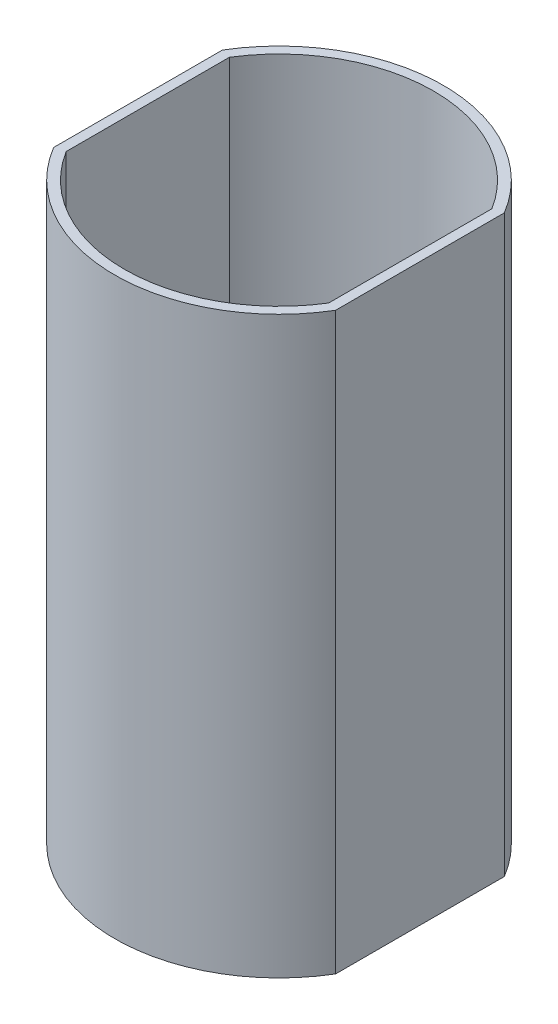
ISO-10303-21;
HEADER;
FILE_DESCRIPTION(('STEP AP214'),'2;1');
FILE_NAME('part.step','',(''),(''),'','','');
FILE_SCHEMA(('AUTOMOTIVE_DESIGN { 1 0 10303 214 1 1 1 1 }'));
ENDSEC;
DATA;
#1=APPLICATION_CONTEXT('core data for automotive mechanical design processes');
#2=APPLICATION_PROTOCOL_DEFINITION('international standard','automotive_design',2000,#1);
#3=PRODUCT_CONTEXT('',#1,'mechanical');
#4=PRODUCT('Part','Part','',(#3));
#5=PRODUCT_RELATED_PRODUCT_CATEGORY('part','',(#4));
#6=PRODUCT_DEFINITION_FORMATION('','',#4);
#7=PRODUCT_DEFINITION_CONTEXT('part definition',#1,'design');
#8=PRODUCT_DEFINITION('design','',#6,#7);
#9=PRODUCT_DEFINITION_SHAPE('','',#8);
#10=(LENGTH_UNIT() NAMED_UNIT(*) SI_UNIT(.MILLI.,.METRE.));
#11=(NAMED_UNIT(*) PLANE_ANGLE_UNIT() SI_UNIT($,.RADIAN.));
#12=(NAMED_UNIT(*) SI_UNIT($,.STERADIAN.) SOLID_ANGLE_UNIT());
#13=UNCERTAINTY_MEASURE_WITH_UNIT(LENGTH_MEASURE(1.E-05),#10,'distance_accuracy_value','');
#14=(GEOMETRIC_REPRESENTATION_CONTEXT(3) GLOBAL_UNCERTAINTY_ASSIGNED_CONTEXT((#13)) GLOBAL_UNIT_ASSIGNED_CONTEXT((#10,
#11,#12)) REPRESENTATION_CONTEXT('',''));
#15=CARTESIAN_POINT('',(0.,0.,0.));
#16=DIRECTION('',(0.,0.,1.));
#17=DIRECTION('',(1.,0.,0.));
#18=AXIS2_PLACEMENT_3D('',#15,#16,#17);
#19=CARTESIAN_POINT('',(0.,1.8,0.));
#20=DIRECTION('',(0.,1.,0.));
#21=DIRECTION('',(0.,0.,1.));
#22=AXIS2_PLACEMENT_3D('',#19,#20,#21);
#23=PLANE('',#22);
#24=CARTESIAN_POINT('',(0.,1.8,0.));
#25=DIRECTION('',(0.,1.,0.));
#26=DIRECTION('',(0.,0.,1.));
#27=AXIS2_PLACEMENT_3D('',#24,#25,#26);
#28=CIRCLE('',#27,7.5);
#29=CARTESIAN_POINT('',(0.,1.8,7.5));
#30=VERTEX_POINT('',#29);
#31=EDGE_CURVE('E201',#30,#30,#28,.T.);
#32=ORIENTED_EDGE('',*,*,#31,.F.);
#33=EDGE_LOOP('',(#32));
#34=FACE_BOUND('',#33,.T.);
#35=CARTESIAN_POINT('',(0.,1.8,0.));
#36=DIRECTION('',(0.,1.,0.));
#37=DIRECTION('',(0.,0.,1.));
#38=AXIS2_PLACEMENT_3D('',#35,#36,#37);
#39=CIRCLE('',#38,28.5);
#40=CARTESIAN_POINT('',(-24.2,1.8,15.0535710049145));
#41=VERTEX_POINT('',#40);
#42=CARTESIAN_POINT('',(-3.5,1.8,28.2842712474619));
#43=VERTEX_POINT('',#42);
#44=EDGE_CURVE('E218',#41,#43,#39,.T.);
#45=ORIENTED_EDGE('',*,*,#44,.T.);
#46=DIRECTION('',(0.,0.,1.));
#47=VECTOR('',#46,1.);
#48=CARTESIAN_POINT('',(-3.5,1.8,20.5));
#49=LINE('',#48,#47);
#50=CARTESIAN_POINT('',(-3.5,1.8,20.5));
#51=VERTEX_POINT('',#50);
#52=EDGE_CURVE('E170',#51,#43,#49,.T.);
#53=ORIENTED_EDGE('',*,*,#52,.F.);
#54=DIRECTION('',(-1.,0.,0.));
#55=VECTOR('',#54,1.);
#56=CARTESIAN_POINT('',(-3.5,1.8,20.5));
#57=LINE('',#56,#55);
#58=CARTESIAN_POINT('',(3.5,1.8,20.5));
#59=VERTEX_POINT('',#58);
#60=EDGE_CURVE('E174',#59,#51,#57,.T.);
#61=ORIENTED_EDGE('',*,*,#60,.F.);
#62=DIRECTION('',(0.,0.,-1.));
#63=VECTOR('',#62,1.);
#64=CARTESIAN_POINT('',(3.5,1.8,20.5));
#65=LINE('',#64,#63);
#66=CARTESIAN_POINT('',(3.5,1.8,28.2842712474619));
#67=VERTEX_POINT('',#66);
#68=EDGE_CURVE('E157',#67,#59,#65,.T.);
#69=ORIENTED_EDGE('',*,*,#68,.F.);
#70=CARTESIAN_POINT('',(24.2,1.8,15.0535710049145));
#71=VERTEX_POINT('',#70);
#72=EDGE_CURVE('E222',#67,#71,#39,.T.);
#73=ORIENTED_EDGE('',*,*,#72,.T.);
#74=DIRECTION('',(0.,0.,-1.));
#75=VECTOR('',#74,1.);
#76=CARTESIAN_POINT('',(24.2,1.8,-30.3));
#77=LINE('',#76,#75);
#78=CARTESIAN_POINT('',(24.2,1.8,-15.0535710049145));
#79=VERTEX_POINT('',#78);
#80=EDGE_CURVE('E232',#71,#79,#77,.T.);
#81=ORIENTED_EDGE('',*,*,#80,.T.);
#82=CARTESIAN_POINT('',(0.,1.8,0.));
#83=DIRECTION('',(0.,1.,0.));
#84=DIRECTION('',(0.,0.,1.));
#85=AXIS2_PLACEMENT_3D('',#82,#83,#84);
#86=CIRCLE('',#85,28.5);
#87=CARTESIAN_POINT('',(3.5,1.8,-28.2842712474619));
#88=VERTEX_POINT('',#87);
#89=EDGE_CURVE('E228',#79,#88,#86,.T.);
#90=ORIENTED_EDGE('',*,*,#89,.T.);
#91=DIRECTION('',(0.,0.,-1.));
#92=VECTOR('',#91,1.);
#93=CARTESIAN_POINT('',(3.5,1.8,-20.5));
#94=LINE('',#93,#92);
#95=CARTESIAN_POINT('',(3.5,1.8,-20.5));
#96=VERTEX_POINT('',#95);
#97=EDGE_CURVE('E178',#96,#88,#94,.T.);
#98=ORIENTED_EDGE('',*,*,#97,.F.);
#99=DIRECTION('',(1.,0.,0.));
#100=VECTOR('',#99,1.);
#101=CARTESIAN_POINT('',(-3.5,1.8,-20.5));
#102=LINE('',#101,#100);
#103=CARTESIAN_POINT('',(-3.5,1.8,-20.5));
#104=VERTEX_POINT('',#103);
#105=EDGE_CURVE('E183',#104,#96,#102,.T.);
#106=ORIENTED_EDGE('',*,*,#105,.F.);
#107=DIRECTION('',(0.,0.,1.));
#108=VECTOR('',#107,1.);
#109=CARTESIAN_POINT('',(-3.5,1.8,-20.5));
#110=LINE('',#109,#108);
#111=CARTESIAN_POINT('',(-3.5,1.8,-28.2842712474619));
#112=VERTEX_POINT('',#111);
#113=EDGE_CURVE('E189',#112,#104,#110,.T.);
#114=ORIENTED_EDGE('',*,*,#113,.F.);
#115=CARTESIAN_POINT('',(-24.2,1.8,-15.0535710049145));
#116=VERTEX_POINT('',#115);
#117=EDGE_CURVE('E221',#112,#116,#86,.T.);
#118=ORIENTED_EDGE('',*,*,#117,.T.);
#119=DIRECTION('',(0.,0.,1.));
#120=VECTOR('',#119,1.);
#121=CARTESIAN_POINT('',(-24.2,1.8,-30.3));
#122=LINE('',#121,#120);
#123=EDGE_CURVE('E226',#116,#41,#122,.T.);
#124=ORIENTED_EDGE('',*,*,#123,.T.);
#125=EDGE_LOOP('',(#45,#53,#61,#69,#73,#81,#90,#98,#106,#114,#118,#124));
#126=FACE_BOUND('',#125,.T.);
#127=ADVANCED_FACE('F33',(#34,#126),#23,.T.);
#128=CARTESIAN_POINT('',(0.,106.,0.));
#129=DIRECTION('',(0.,-1.,0.));
#130=DIRECTION('',(0.,0.,-1.));
#131=AXIS2_PLACEMENT_3D('',#128,#129,#130);
#132=CYLINDRICAL_SURFACE('',#131,28.5);
#133=CARTESIAN_POINT('',(0.,16.8,0.));
#134=DIRECTION('',(0.,1.,0.));
#135=DIRECTION('',(0.,0.,1.));
#136=AXIS2_PLACEMENT_3D('',#133,#134,#135);
#137=CIRCLE('',#136,28.5);
#138=CARTESIAN_POINT('',(-3.5,16.8,28.2842712474619));
#139=VERTEX_POINT('',#138);
#140=CARTESIAN_POINT('',(3.5,16.8,28.2842712474619));
#141=VERTEX_POINT('',#140);
#142=EDGE_CURVE('E41',#139,#141,#137,.T.);
#143=ORIENTED_EDGE('',*,*,#142,.F.);
#144=DIRECTION('',(0.,-1.,0.));
#145=VECTOR('',#144,1.);
#146=CARTESIAN_POINT('',(-3.5,106.,28.2842712474619));
#147=LINE('',#146,#145);
#148=EDGE_CURVE('E11',#139,#43,#147,.T.);
#149=ORIENTED_EDGE('',*,*,#148,.T.);
#150=ORIENTED_EDGE('',*,*,#44,.F.);
#151=DIRECTION('',(0.,-1.,0.));
#152=VECTOR('',#151,1.);
#153=CARTESIAN_POINT('',(-24.2,1.8,15.0535710049145));
#154=LINE('',#153,#152);
#155=CARTESIAN_POINT('',(-24.2,106.,15.0535710049145));
#156=VERTEX_POINT('',#155);
#157=EDGE_CURVE('E214',#41,#156,#154,.F.);
#158=ORIENTED_EDGE('',*,*,#157,.T.);
#159=CARTESIAN_POINT('',(0.,106.,0.));
#160=DIRECTION('',(0.,1.,0.));
#161=DIRECTION('',(0.,0.,1.));
#162=AXIS2_PLACEMENT_3D('',#159,#160,#161);
#163=CIRCLE('',#162,28.5);
#164=CARTESIAN_POINT('',(24.2,106.,15.0535710049145));
#165=VERTEX_POINT('',#164);
#166=EDGE_CURVE('E231',#156,#165,#163,.T.);
#167=ORIENTED_EDGE('',*,*,#166,.T.);
#168=DIRECTION('',(0.,-1.,0.));
#169=VECTOR('',#168,1.);
#170=CARTESIAN_POINT('',(24.2,106.,15.0535710049145));
#171=LINE('',#170,#169);
#172=EDGE_CURVE('E205',#165,#71,#171,.T.);
#173=ORIENTED_EDGE('',*,*,#172,.T.);
#174=ORIENTED_EDGE('',*,*,#72,.F.);
#175=DIRECTION('',(0.,-1.,0.));
#176=VECTOR('',#175,1.);
#177=CARTESIAN_POINT('',(3.5,106.,28.2842712474619));
#178=LINE('',#177,#176);
#179=EDGE_CURVE('E274',#67,#141,#178,.F.);
#180=ORIENTED_EDGE('',*,*,#179,.T.);
#181=EDGE_LOOP('',(#143,#149,#150,#158,#167,#173,#174,#180));
#182=FACE_BOUND('',#181,.T.);
#183=ADVANCED_FACE('F277',(#182),#132,.F.);
#184=CARTESIAN_POINT('',(0.,16.8,0.));
#185=DIRECTION('',(0.,-1.,0.));
#186=DIRECTION('',(0.,0.,-1.));
#187=AXIS2_PLACEMENT_3D('',#184,#185,#186);
#188=CIRCLE('',#187,28.5);
#189=CARTESIAN_POINT('',(-3.5,16.8,-28.2842712474619));
#190=VERTEX_POINT('',#189);
#191=CARTESIAN_POINT('',(3.5,16.8,-28.2842712474619));
#192=VERTEX_POINT('',#191);
#193=EDGE_CURVE('E272',#190,#192,#188,.T.);
#194=ORIENTED_EDGE('',*,*,#193,.T.);
#195=DIRECTION('',(0.,-1.,0.));
#196=VECTOR('',#195,1.);
#197=CARTESIAN_POINT('',(3.5,106.,-28.2842712474619));
#198=LINE('',#197,#196);
#199=EDGE_CURVE('E198',#192,#88,#198,.T.);
#200=ORIENTED_EDGE('',*,*,#199,.T.);
#201=ORIENTED_EDGE('',*,*,#89,.F.);
#202=DIRECTION('',(0.,-1.,0.));
#203=VECTOR('',#202,1.);
#204=CARTESIAN_POINT('',(24.2,1.8,-15.0535710049145));
#205=LINE('',#204,#203);
#206=CARTESIAN_POINT('',(24.2,106.,-15.0535710049145));
#207=VERTEX_POINT('',#206);
#208=EDGE_CURVE('E225',#79,#207,#205,.F.);
#209=ORIENTED_EDGE('',*,*,#208,.T.);
#210=CARTESIAN_POINT('',(0.,106.,0.));
#211=DIRECTION('',(0.,1.,0.));
#212=DIRECTION('',(0.,0.,1.));
#213=AXIS2_PLACEMENT_3D('',#210,#211,#212);
#214=CIRCLE('',#213,28.5);
#215=CARTESIAN_POINT('',(-24.2,106.,-15.0535710049145));
#216=VERTEX_POINT('',#215);
#217=EDGE_CURVE('E241',#207,#216,#214,.T.);
#218=ORIENTED_EDGE('',*,*,#217,.T.);
#219=DIRECTION('',(0.,-1.,0.));
#220=VECTOR('',#219,1.);
#221=CARTESIAN_POINT('',(-24.2,106.,-15.0535710049145));
#222=LINE('',#221,#220);
#223=EDGE_CURVE('E217',#216,#116,#222,.T.);
#224=ORIENTED_EDGE('',*,*,#223,.T.);
#225=ORIENTED_EDGE('',*,*,#117,.F.);
#226=DIRECTION('',(0.,-1.,0.));
#227=VECTOR('',#226,1.);
#228=CARTESIAN_POINT('',(-3.5,106.,-28.2842712474619));
#229=LINE('',#228,#227);
#230=EDGE_CURVE('E195',#112,#190,#229,.F.);
#231=ORIENTED_EDGE('',*,*,#230,.T.);
#232=EDGE_LOOP('',(#194,#200,#201,#209,#218,#224,#225,#231));
#233=FACE_BOUND('',#232,.T.);
#234=ADVANCED_FACE('F306',(#233),#132,.F.);
#235=CARTESIAN_POINT('',(0.,106.,0.));
#236=DIRECTION('',(0.,1.,0.));
#237=DIRECTION('',(0.,0.,1.));
#238=AXIS2_PLACEMENT_3D('',#235,#236,#237);
#239=PLANE('',#238);
#240=DIRECTION('',(0.,0.,-1.));
#241=VECTOR('',#240,1.);
#242=CARTESIAN_POINT('',(-26.,106.,-30.3));
#243=LINE('',#242,#241);
#244=CARTESIAN_POINT('',(-26.,106.,15.5592416267632));
#245=VERTEX_POINT('',#244);
#246=CARTESIAN_POINT('',(-26.,106.,-15.5592416267632));
#247=VERTEX_POINT('',#246);
#248=EDGE_CURVE('E254',#245,#247,#243,.T.);
#249=ORIENTED_EDGE('',*,*,#248,.F.);
#250=CARTESIAN_POINT('',(0.,106.,0.));
#251=DIRECTION('',(0.,1.,0.));
#252=DIRECTION('',(0.,0.,1.));
#253=AXIS2_PLACEMENT_3D('',#250,#251,#252);
#254=CIRCLE('',#253,30.3);
#255=CARTESIAN_POINT('',(26.,106.,15.5592416267632));
#256=VERTEX_POINT('',#255);
#257=EDGE_CURVE('E265',#245,#256,#254,.T.);
#258=ORIENTED_EDGE('',*,*,#257,.T.);
#259=DIRECTION('',(0.,0.,1.));
#260=VECTOR('',#259,1.);
#261=CARTESIAN_POINT('',(26.,106.,-30.3));
#262=LINE('',#261,#260);
#263=CARTESIAN_POINT('',(26.,106.,-15.5592416267632));
#264=VERTEX_POINT('',#263);
#265=EDGE_CURVE('E262',#264,#256,#262,.T.);
#266=ORIENTED_EDGE('',*,*,#265,.F.);
#267=EDGE_CURVE('E268',#264,#247,#254,.T.);
#268=ORIENTED_EDGE('',*,*,#267,.T.);
#269=EDGE_LOOP('',(#249,#258,#266,#268));
#270=FACE_BOUND('',#269,.T.);
#271=ORIENTED_EDGE('',*,*,#166,.F.);
#272=DIRECTION('',(0.,0.,-1.));
#273=VECTOR('',#272,1.);
#274=CARTESIAN_POINT('',(-24.2,106.,0.));
#275=LINE('',#274,#273);
#276=EDGE_CURVE('E216',#156,#216,#275,.T.);
#277=ORIENTED_EDGE('',*,*,#276,.T.);
#278=ORIENTED_EDGE('',*,*,#217,.F.);
#279=DIRECTION('',(0.,0.,1.));
#280=VECTOR('',#279,1.);
#281=CARTESIAN_POINT('',(24.2,106.,0.));
#282=LINE('',#281,#280);
#283=EDGE_CURVE('E234',#207,#165,#282,.T.);
#284=ORIENTED_EDGE('',*,*,#283,.T.);
#285=EDGE_LOOP('',(#271,#277,#278,#284));
#286=FACE_BOUND('',#285,.T.);
#287=ADVANCED_FACE('F328',(#270,#286),#239,.T.);
#288=CARTESIAN_POINT('',(0.,106.,0.));
#289=DIRECTION('',(0.,-1.,0.));
#290=DIRECTION('',(0.,0.,-1.));
#291=AXIS2_PLACEMENT_3D('',#288,#289,#290);
#292=CYLINDRICAL_SURFACE('',#291,30.3);
#293=ORIENTED_EDGE('',*,*,#257,.F.);
#294=DIRECTION('',(0.,-1.,0.));
#295=VECTOR('',#294,1.);
#296=CARTESIAN_POINT('',(-26.,106.,15.5592416267632));
#297=LINE('',#296,#295);
#298=CARTESIAN_POINT('',(-26.,0.,15.5592416267632));
#299=VERTEX_POINT('',#298);
#300=EDGE_CURVE('E251',#299,#245,#297,.F.);
#301=ORIENTED_EDGE('',*,*,#300,.F.);
#302=CARTESIAN_POINT('',(0.,0.,0.));
#303=DIRECTION('',(0.,1.,0.));
#304=DIRECTION('',(0.,0.,1.));
#305=AXIS2_PLACEMENT_3D('',#302,#303,#304);
#306=CIRCLE('',#305,30.3);
#307=CARTESIAN_POINT('',(26.,0.,15.5592416267632));
#308=VERTEX_POINT('',#307);
#309=EDGE_CURVE('E258',#299,#308,#306,.T.);
#310=ORIENTED_EDGE('',*,*,#309,.T.);
#311=DIRECTION('',(0.,-1.,0.));
#312=VECTOR('',#311,1.);
#313=CARTESIAN_POINT('',(26.,106.,15.5592416267632));
#314=LINE('',#313,#312);
#315=EDGE_CURVE('E246',#256,#308,#314,.T.);
#316=ORIENTED_EDGE('',*,*,#315,.F.);
#317=EDGE_LOOP('',(#293,#301,#310,#316));
#318=FACE_BOUND('',#317,.T.);
#319=ADVANCED_FACE('F330',(#318),#292,.T.);
#320=CARTESIAN_POINT('',(26.,0.,-15.5592416267632));
#321=VERTEX_POINT('',#320);
#322=CARTESIAN_POINT('',(-26.,0.,-15.5592416267632));
#323=VERTEX_POINT('',#322);
#324=EDGE_CURVE('E269',#321,#323,#306,.T.);
#325=ORIENTED_EDGE('',*,*,#324,.T.);
#326=DIRECTION('',(0.,-1.,0.));
#327=VECTOR('',#326,1.);
#328=CARTESIAN_POINT('',(-26.,106.,-15.5592416267632));
#329=LINE('',#328,#327);
#330=EDGE_CURVE('E249',#247,#323,#329,.T.);
#331=ORIENTED_EDGE('',*,*,#330,.F.);
#332=ORIENTED_EDGE('',*,*,#267,.F.);
#333=DIRECTION('',(0.,-1.,0.));
#334=VECTOR('',#333,1.);
#335=CARTESIAN_POINT('',(26.,106.,-15.5592416267632));
#336=LINE('',#335,#334);
#337=EDGE_CURVE('E260',#321,#264,#336,.F.);
#338=ORIENTED_EDGE('',*,*,#337,.F.);
#339=EDGE_LOOP('',(#325,#331,#332,#338));
#340=FACE_BOUND('',#339,.T.);
#341=ADVANCED_FACE('F35',(#340),#292,.T.);
#342=CARTESIAN_POINT('',(0.,0.,0.));
#343=DIRECTION('',(0.,1.,0.));
#344=DIRECTION('',(0.,0.,1.));
#345=AXIS2_PLACEMENT_3D('',#342,#343,#344);
#346=PLANE('',#345);
#347=CARTESIAN_POINT('',(0.,0.,-23.5));
#348=DIRECTION('',(0.,1.,0.));
#349=DIRECTION('',(0.,0.,1.));
#350=AXIS2_PLACEMENT_3D('',#347,#348,#349);
#351=CIRCLE('',#350,1.75);
#352=CARTESIAN_POINT('',(0.,0.,-21.75));
#353=VERTEX_POINT('',#352);
#354=EDGE_CURVE('E202',#353,#353,#351,.F.);
#355=ORIENTED_EDGE('',*,*,#354,.F.);
#356=EDGE_LOOP('',(#355));
#357=FACE_BOUND('',#356,.T.);
#358=CARTESIAN_POINT('',(0.,0.,23.5));
#359=DIRECTION('',(0.,1.,0.));
#360=DIRECTION('',(0.,0.,1.));
#361=AXIS2_PLACEMENT_3D('',#358,#359,#360);
#362=CIRCLE('',#361,1.75);
#363=CARTESIAN_POINT('',(0.,0.,25.25));
#364=VERTEX_POINT('',#363);
#365=EDGE_CURVE('E206',#364,#364,#362,.F.);
#366=ORIENTED_EDGE('',*,*,#365,.F.);
#367=EDGE_LOOP('',(#366));
#368=FACE_BOUND('',#367,.T.);
#369=CARTESIAN_POINT('',(0.,0.,0.));
#370=DIRECTION('',(0.,1.,0.));
#371=DIRECTION('',(0.,0.,1.));
#372=AXIS2_PLACEMENT_3D('',#369,#370,#371);
#373=CIRCLE('',#372,7.5);
#374=CARTESIAN_POINT('',(0.,0.,7.5));
#375=VERTEX_POINT('',#374);
#376=EDGE_CURVE('E209',#375,#375,#373,.F.);
#377=ORIENTED_EDGE('',*,*,#376,.F.);
#378=EDGE_LOOP('',(#377));
#379=FACE_BOUND('',#378,.T.);
#380=ORIENTED_EDGE('',*,*,#309,.F.);
#381=DIRECTION('',(0.,0.,1.));
#382=VECTOR('',#381,1.);
#383=CARTESIAN_POINT('',(-26.,0.,-30.3));
#384=LINE('',#383,#382);
#385=EDGE_CURVE('E256',#323,#299,#384,.T.);
#386=ORIENTED_EDGE('',*,*,#385,.F.);
#387=ORIENTED_EDGE('',*,*,#324,.F.);
#388=DIRECTION('',(0.,0.,-1.));
#389=VECTOR('',#388,1.);
#390=CARTESIAN_POINT('',(26.,0.,-30.3));
#391=LINE('',#390,#389);
#392=EDGE_CURVE('E252',#308,#321,#391,.T.);
#393=ORIENTED_EDGE('',*,*,#392,.F.);
#394=EDGE_LOOP('',(#380,#386,#387,#393));
#395=FACE_BOUND('',#394,.T.);
#396=ADVANCED_FACE('F326',(#357,#368,#379,#395),#346,.F.);
#397=CARTESIAN_POINT('',(26.,-0.001000000000001,-30.3));
#398=DIRECTION('',(-1.,0.,0.));
#399=DIRECTION('',(0.,0.,1.));
#400=AXIS2_PLACEMENT_3D('',#397,#398,#399);
#401=PLANE('',#400);
#402=ORIENTED_EDGE('',*,*,#337,.T.);
#403=ORIENTED_EDGE('',*,*,#265,.T.);
#404=ORIENTED_EDGE('',*,*,#315,.T.);
#405=ORIENTED_EDGE('',*,*,#392,.T.);
#406=EDGE_LOOP('',(#402,#403,#404,#405));
#407=FACE_BOUND('',#406,.T.);
#408=ADVANCED_FACE('F322',(#407),#401,.F.);
#409=CARTESIAN_POINT('',(-26.,-0.001000000000001,-30.3));
#410=DIRECTION('',(1.,0.,0.));
#411=DIRECTION('',(0.,0.,-1.));
#412=AXIS2_PLACEMENT_3D('',#409,#410,#411);
#413=PLANE('',#412);
#414=ORIENTED_EDGE('',*,*,#300,.T.);
#415=ORIENTED_EDGE('',*,*,#248,.T.);
#416=ORIENTED_EDGE('',*,*,#330,.T.);
#417=ORIENTED_EDGE('',*,*,#385,.T.);
#418=EDGE_LOOP('',(#414,#415,#416,#417));
#419=FACE_BOUND('',#418,.T.);
#420=ADVANCED_FACE('F315',(#419),#413,.F.);
#421=CARTESIAN_POINT('',(24.2,-0.001000000000001,-30.3));
#422=DIRECTION('',(-1.,0.,0.));
#423=DIRECTION('',(0.,0.,1.));
#424=AXIS2_PLACEMENT_3D('',#421,#422,#423);
#425=PLANE('',#424);
#426=ORIENTED_EDGE('',*,*,#208,.F.);
#427=ORIENTED_EDGE('',*,*,#80,.F.);
#428=ORIENTED_EDGE('',*,*,#172,.F.);
#429=ORIENTED_EDGE('',*,*,#283,.F.);
#430=EDGE_LOOP('',(#426,#427,#428,#429));
#431=FACE_BOUND('',#430,.T.);
#432=ADVANCED_FACE('F311',(#431),#425,.T.);
#433=CARTESIAN_POINT('',(-24.2,-0.001000000000001,-30.3));
#434=DIRECTION('',(1.,0.,0.));
#435=DIRECTION('',(0.,0.,-1.));
#436=AXIS2_PLACEMENT_3D('',#433,#434,#435);
#437=PLANE('',#436);
#438=ORIENTED_EDGE('',*,*,#157,.F.);
#439=ORIENTED_EDGE('',*,*,#123,.F.);
#440=ORIENTED_EDGE('',*,*,#223,.F.);
#441=ORIENTED_EDGE('',*,*,#276,.F.);
#442=EDGE_LOOP('',(#438,#439,#440,#441));
#443=FACE_BOUND('',#442,.T.);
#444=ADVANCED_FACE('F314',(#443),#437,.T.);
#445=CARTESIAN_POINT('',(0.,-0.000999999999999916,23.5));
#446=DIRECTION('',(0.,1.,0.));
#447=DIRECTION('',(0.,0.,1.));
#448=AXIS2_PLACEMENT_3D('',#445,#446,#447);
#449=CYLINDRICAL_SURFACE('',#448,1.75);
#450=ORIENTED_EDGE('',*,*,#365,.T.);
#451=EDGE_LOOP('',(#450));
#452=FACE_BOUND('',#451,.T.);
#453=CARTESIAN_POINT('',(0.,16.8,23.5));
#454=DIRECTION('',(0.,1.,0.));
#455=DIRECTION('',(0.,0.,-1.));
#456=AXIS2_PLACEMENT_3D('',#453,#454,#455);
#457=CIRCLE('',#456,1.75);
#458=CARTESIAN_POINT('',(0.,16.8,21.75));
#459=VERTEX_POINT('',#458);
#460=EDGE_CURVE('E172',#459,#459,#457,.T.);
#461=ORIENTED_EDGE('',*,*,#460,.T.);
#462=EDGE_LOOP('',(#461));
#463=FACE_BOUND('',#462,.T.);
#464=ADVANCED_FACE('F287',(#452,#463),#449,.F.);
#465=CARTESIAN_POINT('',(0.,-0.000999999999999916,-23.5));
#466=DIRECTION('',(0.,1.,0.));
#467=DIRECTION('',(0.,0.,1.));
#468=AXIS2_PLACEMENT_3D('',#465,#466,#467);
#469=CYLINDRICAL_SURFACE('',#468,1.75);
#470=ORIENTED_EDGE('',*,*,#354,.T.);
#471=EDGE_LOOP('',(#470));
#472=FACE_BOUND('',#471,.T.);
#473=CARTESIAN_POINT('',(0.,16.8,-23.5));
#474=DIRECTION('',(0.,1.,0.));
#475=DIRECTION('',(0.,0.,1.));
#476=AXIS2_PLACEMENT_3D('',#473,#474,#475);
#477=CIRCLE('',#476,1.75);
#478=CARTESIAN_POINT('',(0.,16.8,-21.75));
#479=VERTEX_POINT('',#478);
#480=EDGE_CURVE('E160',#479,#479,#477,.T.);
#481=ORIENTED_EDGE('',*,*,#480,.T.);
#482=EDGE_LOOP('',(#481));
#483=FACE_BOUND('',#482,.T.);
#484=ADVANCED_FACE('F391',(#472,#483),#469,.F.);
#485=CARTESIAN_POINT('',(0.,-0.000999999999999916,0.));
#486=DIRECTION('',(0.,1.,0.));
#487=DIRECTION('',(0.,0.,1.));
#488=AXIS2_PLACEMENT_3D('',#485,#486,#487);
#489=CYLINDRICAL_SURFACE('',#488,7.5);
#490=ORIENTED_EDGE('',*,*,#31,.T.);
#491=EDGE_LOOP('',(#490));
#492=FACE_BOUND('',#491,.T.);
#493=ORIENTED_EDGE('',*,*,#376,.T.);
#494=EDGE_LOOP('',(#493));
#495=FACE_BOUND('',#494,.T.);
#496=ADVANCED_FACE('F394',(#492,#495),#489,.F.);
#497=CARTESIAN_POINT('',(0.,16.8,0.));
#498=DIRECTION('',(0.,-1.,0.));
#499=DIRECTION('',(0.,0.,-1.));
#500=AXIS2_PLACEMENT_3D('',#497,#498,#499);
#501=PLANE('',#500);
#502=ORIENTED_EDGE('',*,*,#480,.F.);
#503=EDGE_LOOP('',(#502));
#504=FACE_BOUND('',#503,.T.);
#505=DIRECTION('',(0.,0.,-1.));
#506=VECTOR('',#505,1.);
#507=CARTESIAN_POINT('',(3.5,16.8,-20.5));
#508=LINE('',#507,#506);
#509=CARTESIAN_POINT('',(3.5,16.8,-20.5));
#510=VERTEX_POINT('',#509);
#511=EDGE_CURVE('E179',#510,#192,#508,.T.);
#512=ORIENTED_EDGE('',*,*,#511,.T.);
#513=ORIENTED_EDGE('',*,*,#193,.F.);
#514=DIRECTION('',(0.,0.,1.));
#515=VECTOR('',#514,1.);
#516=CARTESIAN_POINT('',(-3.5,16.8,-20.5));
#517=LINE('',#516,#515);
#518=CARTESIAN_POINT('',(-3.5,16.8,-20.5));
#519=VERTEX_POINT('',#518);
#520=EDGE_CURVE('E182',#190,#519,#517,.T.);
#521=ORIENTED_EDGE('',*,*,#520,.T.);
#522=DIRECTION('',(1.,0.,0.));
#523=VECTOR('',#522,1.);
#524=CARTESIAN_POINT('',(-3.5,16.8,-20.5));
#525=LINE('',#524,#523);
#526=EDGE_CURVE('E185',#519,#510,#525,.T.);
#527=ORIENTED_EDGE('',*,*,#526,.T.);
#528=EDGE_LOOP('',(#512,#513,#521,#527));
#529=FACE_BOUND('',#528,.T.);
#530=ADVANCED_FACE('F381',(#504,#529),#501,.F.);
#531=CARTESIAN_POINT('',(3.5,16.8,-20.5));
#532=DIRECTION('',(-1.,0.,0.));
#533=DIRECTION('',(0.,0.,1.));
#534=AXIS2_PLACEMENT_3D('',#531,#532,#533);
#535=PLANE('',#534);
#536=ORIENTED_EDGE('',*,*,#199,.F.);
#537=ORIENTED_EDGE('',*,*,#511,.F.);
#538=DIRECTION('',(0.,-1.,0.));
#539=VECTOR('',#538,1.);
#540=CARTESIAN_POINT('',(3.5,16.8,-20.5));
#541=LINE('',#540,#539);
#542=EDGE_CURVE('E187',#510,#96,#541,.T.);
#543=ORIENTED_EDGE('',*,*,#542,.T.);
#544=ORIENTED_EDGE('',*,*,#97,.T.);
#545=EDGE_LOOP('',(#536,#537,#543,#544));
#546=FACE_BOUND('',#545,.T.);
#547=ADVANCED_FACE('F376',(#546),#535,.F.);
#548=CARTESIAN_POINT('',(-3.5,16.8,-20.5));
#549=DIRECTION('',(1.,0.,0.));
#550=DIRECTION('',(0.,0.,-1.));
#551=AXIS2_PLACEMENT_3D('',#548,#549,#550);
#552=PLANE('',#551);
#553=ORIENTED_EDGE('',*,*,#230,.F.);
#554=ORIENTED_EDGE('',*,*,#113,.T.);
#555=DIRECTION('',(0.,-1.,0.));
#556=VECTOR('',#555,1.);
#557=CARTESIAN_POINT('',(-3.5,16.8,-20.5));
#558=LINE('',#557,#556);
#559=EDGE_CURVE('E56',#519,#104,#558,.T.);
#560=ORIENTED_EDGE('',*,*,#559,.F.);
#561=ORIENTED_EDGE('',*,*,#520,.F.);
#562=EDGE_LOOP('',(#553,#554,#560,#561));
#563=FACE_BOUND('',#562,.T.);
#564=ADVANCED_FACE('F297',(#563),#552,.F.);
#565=CARTESIAN_POINT('',(-3.5,16.8,-20.5));
#566=DIRECTION('',(0.,0.,-1.));
#567=DIRECTION('',(-1.,0.,0.));
#568=AXIS2_PLACEMENT_3D('',#565,#566,#567);
#569=PLANE('',#568);
#570=ORIENTED_EDGE('',*,*,#105,.T.);
#571=ORIENTED_EDGE('',*,*,#542,.F.);
#572=ORIENTED_EDGE('',*,*,#526,.F.);
#573=ORIENTED_EDGE('',*,*,#559,.T.);
#574=EDGE_LOOP('',(#570,#571,#572,#573));
#575=FACE_BOUND('',#574,.T.);
#576=ADVANCED_FACE('F290',(#575),#569,.F.);
#577=CARTESIAN_POINT('',(0.,16.8,0.));
#578=DIRECTION('',(0.,1.,0.));
#579=DIRECTION('',(0.,0.,1.));
#580=AXIS2_PLACEMENT_3D('',#577,#578,#579);
#581=PLANE('',#580);
#582=ORIENTED_EDGE('',*,*,#460,.F.);
#583=EDGE_LOOP('',(#582));
#584=FACE_BOUND('',#583,.T.);
#585=DIRECTION('',(0.,0.,1.));
#586=VECTOR('',#585,1.);
#587=CARTESIAN_POINT('',(-3.5,16.8,20.5));
#588=LINE('',#587,#586);
#589=CARTESIAN_POINT('',(-3.5,16.8,20.5));
#590=VERTEX_POINT('',#589);
#591=EDGE_CURVE('E151',#590,#139,#588,.T.);
#592=ORIENTED_EDGE('',*,*,#591,.T.);
#593=ORIENTED_EDGE('',*,*,#142,.T.);
#594=DIRECTION('',(0.,0.,-1.));
#595=VECTOR('',#594,1.);
#596=CARTESIAN_POINT('',(3.5,16.8,20.5));
#597=LINE('',#596,#595);
#598=CARTESIAN_POINT('',(3.5,16.8,20.5));
#599=VERTEX_POINT('',#598);
#600=EDGE_CURVE('E48',#141,#599,#597,.T.);
#601=ORIENTED_EDGE('',*,*,#600,.T.);
#602=DIRECTION('',(-1.,0.,0.));
#603=VECTOR('',#602,1.);
#604=CARTESIAN_POINT('',(-3.5,16.8,20.5));
#605=LINE('',#604,#603);
#606=EDGE_CURVE('E148',#599,#590,#605,.T.);
#607=ORIENTED_EDGE('',*,*,#606,.T.);
#608=EDGE_LOOP('',(#592,#593,#601,#607));
#609=FACE_BOUND('',#608,.T.);
#610=ADVANCED_FACE('F146',(#584,#609),#581,.T.);
#611=CARTESIAN_POINT('',(-3.5,16.8,20.5));
#612=DIRECTION('',(1.,0.,0.));
#613=DIRECTION('',(0.,0.,-1.));
#614=AXIS2_PLACEMENT_3D('',#611,#612,#613);
#615=PLANE('',#614);
#616=ORIENTED_EDGE('',*,*,#148,.F.);
#617=ORIENTED_EDGE('',*,*,#591,.F.);
#618=DIRECTION('',(0.,-1.,0.));
#619=VECTOR('',#618,1.);
#620=CARTESIAN_POINT('',(-3.5,16.8,20.5));
#621=LINE('',#620,#619);
#622=EDGE_CURVE('E161',#590,#51,#621,.T.);
#623=ORIENTED_EDGE('',*,*,#622,.T.);
#624=ORIENTED_EDGE('',*,*,#52,.T.);
#625=EDGE_LOOP('',(#616,#617,#623,#624));
#626=FACE_BOUND('',#625,.T.);
#627=ADVANCED_FACE('F282',(#626),#615,.F.);
#628=CARTESIAN_POINT('',(3.5,16.8,20.5));
#629=DIRECTION('',(-1.,0.,0.));
#630=DIRECTION('',(0.,0.,1.));
#631=AXIS2_PLACEMENT_3D('',#628,#629,#630);
#632=PLANE('',#631);
#633=ORIENTED_EDGE('',*,*,#179,.F.);
#634=ORIENTED_EDGE('',*,*,#68,.T.);
#635=DIRECTION('',(0.,-1.,0.));
#636=VECTOR('',#635,1.);
#637=CARTESIAN_POINT('',(3.5,16.8,20.5));
#638=LINE('',#637,#636);
#639=EDGE_CURVE('E154',#599,#59,#638,.T.);
#640=ORIENTED_EDGE('',*,*,#639,.F.);
#641=ORIENTED_EDGE('',*,*,#600,.F.);
#642=EDGE_LOOP('',(#633,#634,#640,#641));
#643=FACE_BOUND('',#642,.T.);
#644=ADVANCED_FACE('F155',(#643),#632,.F.);
#645=CARTESIAN_POINT('',(-3.5,16.8,20.5));
#646=DIRECTION('',(0.,0.,1.));
#647=DIRECTION('',(1.,0.,0.));
#648=AXIS2_PLACEMENT_3D('',#645,#646,#647);
#649=PLANE('',#648);
#650=ORIENTED_EDGE('',*,*,#60,.T.);
#651=ORIENTED_EDGE('',*,*,#622,.F.);
#652=ORIENTED_EDGE('',*,*,#606,.F.);
#653=ORIENTED_EDGE('',*,*,#639,.T.);
#654=EDGE_LOOP('',(#650,#651,#652,#653));
#655=FACE_BOUND('',#654,.T.);
#656=ADVANCED_FACE('F163',(#655),#649,.F.);
#657=CLOSED_SHELL('',(#127,#183,#234,#287,#319,#341,#396,#408,#420,#432,#444,#464,#484,#496,
#530,#547,#564,#576,#610,#627,#644,#656));
#658=MANIFOLD_SOLID_BREP('B2',#657);
#659=ADVANCED_BREP_SHAPE_REPRESENTATION('',(#18,#658),#14);
#660=SHAPE_DEFINITION_REPRESENTATION(#9,#659);
ENDSEC;
END-ISO-10303-21;
